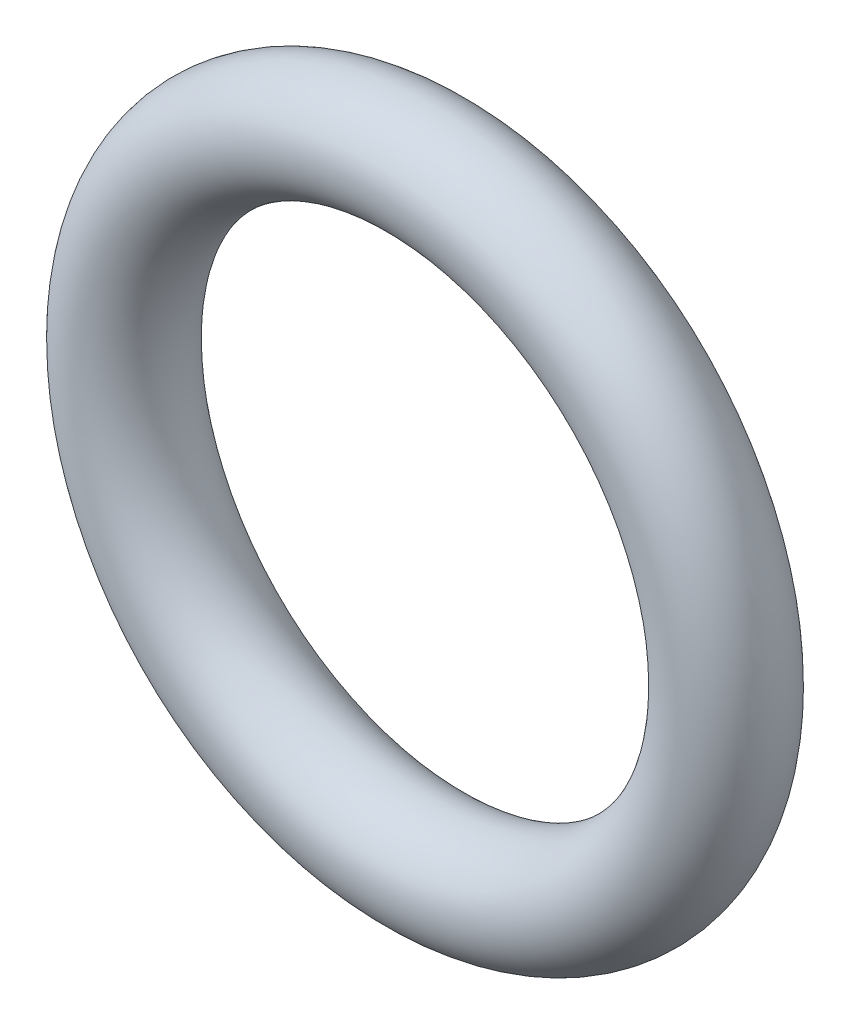
ISO-10303-21;
HEADER;
FILE_DESCRIPTION(('STEP AP214'),'2;1');
FILE_NAME('part.step','',(''),(''),'','','');
FILE_SCHEMA(('AUTOMOTIVE_DESIGN { 1 0 10303 214 1 1 1 1 }'));
ENDSEC;
DATA;
#1=APPLICATION_CONTEXT('core data for automotive mechanical design processes');
#2=APPLICATION_PROTOCOL_DEFINITION('international standard','automotive_design',2000,#1);
#3=PRODUCT_CONTEXT('',#1,'mechanical');
#4=PRODUCT('Part','Part','',(#3));
#5=PRODUCT_RELATED_PRODUCT_CATEGORY('part','',(#4));
#6=PRODUCT_DEFINITION_FORMATION('','',#4);
#7=PRODUCT_DEFINITION_CONTEXT('part definition',#1,'design');
#8=PRODUCT_DEFINITION('design','',#6,#7);
#9=PRODUCT_DEFINITION_SHAPE('','',#8);
#10=(LENGTH_UNIT() NAMED_UNIT(*) SI_UNIT(.MILLI.,.METRE.));
#11=(NAMED_UNIT(*) PLANE_ANGLE_UNIT() SI_UNIT($,.RADIAN.));
#12=(NAMED_UNIT(*) SI_UNIT($,.STERADIAN.) SOLID_ANGLE_UNIT());
#13=UNCERTAINTY_MEASURE_WITH_UNIT(LENGTH_MEASURE(1.E-05),#10,'distance_accuracy_value','');
#14=(GEOMETRIC_REPRESENTATION_CONTEXT(3) GLOBAL_UNCERTAINTY_ASSIGNED_CONTEXT((#13)) GLOBAL_UNIT_ASSIGNED_CONTEXT((#10,
#11,#12)) REPRESENTATION_CONTEXT('',''));
#15=CARTESIAN_POINT('',(0.,0.,0.));
#16=DIRECTION('',(0.,0.,1.));
#17=DIRECTION('',(1.,0.,0.));
#18=AXIS2_PLACEMENT_3D('',#15,#16,#17);
#19=CARTESIAN_POINT('',(0.,0.,0.));
#20=DIRECTION('',(0.,0.,-1.));
#21=DIRECTION('',(-1.,0.,0.));
#22=AXIS2_PLACEMENT_3D('',#19,#20,#21);
#23=TOROIDAL_SURFACE('',#22,2.75,0.5);
#24=CARTESIAN_POINT('',(-3.25,0.,0.));
#25=VERTEX_POINT('',#24);
#26=VERTEX_LOOP('',#25);
#27=FACE_BOUND('',#26,.T.);
#28=ADVANCED_FACE('F28',(#27),#23,.T.);
#29=CLOSED_SHELL('',(#28));
#30=MANIFOLD_SOLID_BREP('B2',#29);
#31=ADVANCED_BREP_SHAPE_REPRESENTATION('',(#18,#30),#14);
#32=SHAPE_DEFINITION_REPRESENTATION(#9,#31);
ENDSEC;
END-ISO-10303-21;
